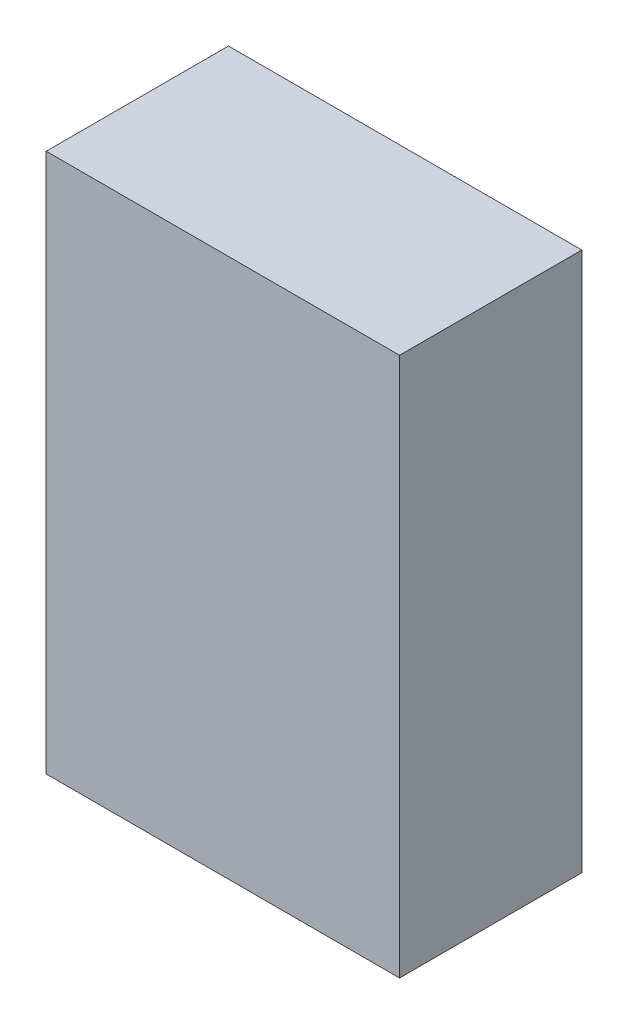
ISO-10303-21;
HEADER;
FILE_DESCRIPTION(('STEP AP214'),'2;1');
FILE_NAME('part.step','',(''),(''),'','','');
FILE_SCHEMA(('AUTOMOTIVE_DESIGN { 1 0 10303 214 1 1 1 1 }'));
ENDSEC;
DATA;
#1=APPLICATION_CONTEXT('core data for automotive mechanical design processes');
#2=APPLICATION_PROTOCOL_DEFINITION('international standard','automotive_design',2000,#1);
#3=PRODUCT_CONTEXT('',#1,'mechanical');
#4=PRODUCT('Part','Part','',(#3));
#5=PRODUCT_RELATED_PRODUCT_CATEGORY('part','',(#4));
#6=PRODUCT_DEFINITION_FORMATION('','',#4);
#7=PRODUCT_DEFINITION_CONTEXT('part definition',#1,'design');
#8=PRODUCT_DEFINITION('design','',#6,#7);
#9=PRODUCT_DEFINITION_SHAPE('','',#8);
#10=(LENGTH_UNIT() NAMED_UNIT(*) SI_UNIT(.MILLI.,.METRE.));
#11=(NAMED_UNIT(*) PLANE_ANGLE_UNIT() SI_UNIT($,.RADIAN.));
#12=(NAMED_UNIT(*) SI_UNIT($,.STERADIAN.) SOLID_ANGLE_UNIT());
#13=UNCERTAINTY_MEASURE_WITH_UNIT(LENGTH_MEASURE(1.E-05),#10,'distance_accuracy_value','');
#14=(GEOMETRIC_REPRESENTATION_CONTEXT(3) GLOBAL_UNCERTAINTY_ASSIGNED_CONTEXT((#13)) GLOBAL_UNIT_ASSIGNED_CONTEXT((#10,
#11,#12)) REPRESENTATION_CONTEXT('',''));
#15=CARTESIAN_POINT('',(0.,0.,0.));
#16=DIRECTION('',(0.,0.,1.));
#17=DIRECTION('',(1.,0.,0.));
#18=AXIS2_PLACEMENT_3D('',#15,#16,#17);
#19=CARTESIAN_POINT('',(-0.95000064,-1.44999964,0.98000058));
#20=DIRECTION('',(0.,0.,1.));
#21=DIRECTION('',(1.,0.,0.));
#22=AXIS2_PLACEMENT_3D('',#19,#20,#21);
#23=PLANE('',#22);
#24=DIRECTION('',(1.,0.,0.));
#25=VECTOR('',#24,1.);
#26=CARTESIAN_POINT('',(-0.95000064,1.44999964,0.98000058));
#27=LINE('',#26,#25);
#28=CARTESIAN_POINT('',(-0.95000064,1.44999964,0.98000058));
#29=VERTEX_POINT('',#28);
#30=CARTESIAN_POINT('',(0.95000064,1.44999964,0.98000058));
#31=VERTEX_POINT('',#30);
#32=EDGE_CURVE('E53',#29,#31,#27,.T.);
#33=ORIENTED_EDGE('',*,*,#32,.F.);
#34=DIRECTION('',(0.,1.,0.));
#35=VECTOR('',#34,1.);
#36=CARTESIAN_POINT('',(-0.95000064,-1.44999964,0.98000058));
#37=LINE('',#36,#35);
#38=CARTESIAN_POINT('',(-0.95000064,-1.44999964,0.98000058));
#39=VERTEX_POINT('',#38);
#40=EDGE_CURVE('E68',#39,#29,#37,.T.);
#41=ORIENTED_EDGE('',*,*,#40,.F.);
#42=DIRECTION('',(1.,0.,0.));
#43=VECTOR('',#42,1.);
#44=CARTESIAN_POINT('',(0.95000064,-1.44999964,0.98000058));
#45=LINE('',#44,#43);
#46=CARTESIAN_POINT('',(0.95000064,-1.44999964,0.98000058));
#47=VERTEX_POINT('',#46);
#48=EDGE_CURVE('E20',#47,#39,#45,.F.);
#49=ORIENTED_EDGE('',*,*,#48,.F.);
#50=DIRECTION('',(0.,1.,0.));
#51=VECTOR('',#50,1.);
#52=CARTESIAN_POINT('',(0.95000064,1.44999964,0.98000058));
#53=LINE('',#52,#51);
#54=EDGE_CURVE('E58',#31,#47,#53,.F.);
#55=ORIENTED_EDGE('',*,*,#54,.F.);
#56=EDGE_LOOP('',(#33,#41,#49,#55));
#57=FACE_BOUND('',#56,.T.);
#58=ADVANCED_FACE('F17',(#57),#23,.T.);
#59=CARTESIAN_POINT('',(0.95000064,-1.44999964,0.));
#60=DIRECTION('',(0.,-1.,0.));
#61=DIRECTION('',(0.,0.,-1.));
#62=AXIS2_PLACEMENT_3D('',#59,#60,#61);
#63=PLANE('',#62);
#64=DIRECTION('',(0.,0.,1.));
#65=VECTOR('',#64,1.);
#66=CARTESIAN_POINT('',(-0.95000064,-1.44999964,0.));
#67=LINE('',#66,#65);
#68=CARTESIAN_POINT('',(-0.95000064,-1.44999964,0.));
#69=VERTEX_POINT('',#68);
#70=EDGE_CURVE('E79',#69,#39,#67,.T.);
#71=ORIENTED_EDGE('',*,*,#70,.F.);
#72=DIRECTION('',(1.,0.,0.));
#73=VECTOR('',#72,1.);
#74=CARTESIAN_POINT('',(-0.95000064,-1.44999964,0.));
#75=LINE('',#74,#73);
#76=CARTESIAN_POINT('',(0.95000064,-1.44999964,0.));
#77=VERTEX_POINT('',#76);
#78=EDGE_CURVE('E74',#69,#77,#75,.T.);
#79=ORIENTED_EDGE('',*,*,#78,.T.);
#80=DIRECTION('',(0.,0.,-1.));
#81=VECTOR('',#80,1.);
#82=CARTESIAN_POINT('',(0.95000064,-1.44999964,0.));
#83=LINE('',#82,#81);
#84=EDGE_CURVE('E63',#47,#77,#83,.T.);
#85=ORIENTED_EDGE('',*,*,#84,.F.);
#86=ORIENTED_EDGE('',*,*,#48,.T.);
#87=EDGE_LOOP('',(#71,#79,#85,#86));
#88=FACE_BOUND('',#87,.T.);
#89=ADVANCED_FACE('F73',(#88),#63,.T.);
#90=CARTESIAN_POINT('',(0.95000064,1.44999964,0.));
#91=DIRECTION('',(1.,0.,0.));
#92=DIRECTION('',(0.,0.,-1.));
#93=AXIS2_PLACEMENT_3D('',#90,#91,#92);
#94=PLANE('',#93);
#95=ORIENTED_EDGE('',*,*,#84,.T.);
#96=DIRECTION('',(0.,1.,0.));
#97=VECTOR('',#96,1.);
#98=CARTESIAN_POINT('',(0.95000064,-1.44999964,0.));
#99=LINE('',#98,#97);
#100=CARTESIAN_POINT('',(0.95000064,1.44999964,0.));
#101=VERTEX_POINT('',#100);
#102=EDGE_CURVE('E84',#77,#101,#99,.T.);
#103=ORIENTED_EDGE('',*,*,#102,.T.);
#104=DIRECTION('',(0.,0.,1.));
#105=VECTOR('',#104,1.);
#106=CARTESIAN_POINT('',(0.95000064,1.44999964,0.));
#107=LINE('',#106,#105);
#108=EDGE_CURVE('E65',#31,#101,#107,.F.);
#109=ORIENTED_EDGE('',*,*,#108,.F.);
#110=ORIENTED_EDGE('',*,*,#54,.T.);
#111=EDGE_LOOP('',(#95,#103,#109,#110));
#112=FACE_BOUND('',#111,.T.);
#113=ADVANCED_FACE('F60',(#112),#94,.T.);
#114=CARTESIAN_POINT('',(-0.95000064,1.44999964,0.));
#115=DIRECTION('',(0.,1.,0.));
#116=DIRECTION('',(0.,0.,1.));
#117=AXIS2_PLACEMENT_3D('',#114,#115,#116);
#118=PLANE('',#117);
#119=ORIENTED_EDGE('',*,*,#108,.T.);
#120=DIRECTION('',(1.,0.,0.));
#121=VECTOR('',#120,1.);
#122=CARTESIAN_POINT('',(-0.95000064,1.44999964,0.));
#123=LINE('',#122,#121);
#124=CARTESIAN_POINT('',(-0.95000064,1.44999964,0.));
#125=VERTEX_POINT('',#124);
#126=EDGE_CURVE('E26',#101,#125,#123,.F.);
#127=ORIENTED_EDGE('',*,*,#126,.T.);
#128=DIRECTION('',(0.,0.,1.));
#129=VECTOR('',#128,1.);
#130=CARTESIAN_POINT('',(-0.95000064,1.44999964,0.));
#131=LINE('',#130,#129);
#132=EDGE_CURVE('E34',#29,#125,#131,.F.);
#133=ORIENTED_EDGE('',*,*,#132,.F.);
#134=ORIENTED_EDGE('',*,*,#32,.T.);
#135=EDGE_LOOP('',(#119,#127,#133,#134));
#136=FACE_BOUND('',#135,.T.);
#137=ADVANCED_FACE('F88',(#136),#118,.T.);
#138=CARTESIAN_POINT('',(-0.95000064,-1.44999964,0.));
#139=DIRECTION('',(-1.,0.,0.));
#140=DIRECTION('',(0.,0.,1.));
#141=AXIS2_PLACEMENT_3D('',#138,#139,#140);
#142=PLANE('',#141);
#143=ORIENTED_EDGE('',*,*,#132,.T.);
#144=DIRECTION('',(0.,1.,0.));
#145=VECTOR('',#144,1.);
#146=CARTESIAN_POINT('',(-0.95000064,-1.44999964,0.));
#147=LINE('',#146,#145);
#148=EDGE_CURVE('E11',#125,#69,#147,.F.);
#149=ORIENTED_EDGE('',*,*,#148,.T.);
#150=ORIENTED_EDGE('',*,*,#70,.T.);
#151=ORIENTED_EDGE('',*,*,#40,.T.);
#152=EDGE_LOOP('',(#143,#149,#150,#151));
#153=FACE_BOUND('',#152,.T.);
#154=ADVANCED_FACE('F91',(#153),#142,.T.);
#155=CARTESIAN_POINT('',(-0.95000064,-1.44999964,0.));
#156=DIRECTION('',(0.,0.,1.));
#157=DIRECTION('',(1.,0.,0.));
#158=AXIS2_PLACEMENT_3D('',#155,#156,#157);
#159=PLANE('',#158);
#160=ORIENTED_EDGE('',*,*,#126,.F.);
#161=ORIENTED_EDGE('',*,*,#102,.F.);
#162=ORIENTED_EDGE('',*,*,#78,.F.);
#163=ORIENTED_EDGE('',*,*,#148,.F.);
#164=EDGE_LOOP('',(#160,#161,#162,#163));
#165=FACE_BOUND('',#164,.T.);
#166=ADVANCED_FACE('F90',(#165),#159,.F.);
#167=CLOSED_SHELL('',(#58,#89,#113,#137,#154,#166));
#168=MANIFOLD_SOLID_BREP('B1',#167);
#169=ADVANCED_BREP_SHAPE_REPRESENTATION('',(#18,#168),#14);
#170=SHAPE_DEFINITION_REPRESENTATION(#9,#169);
ENDSEC;
END-ISO-10303-21;
